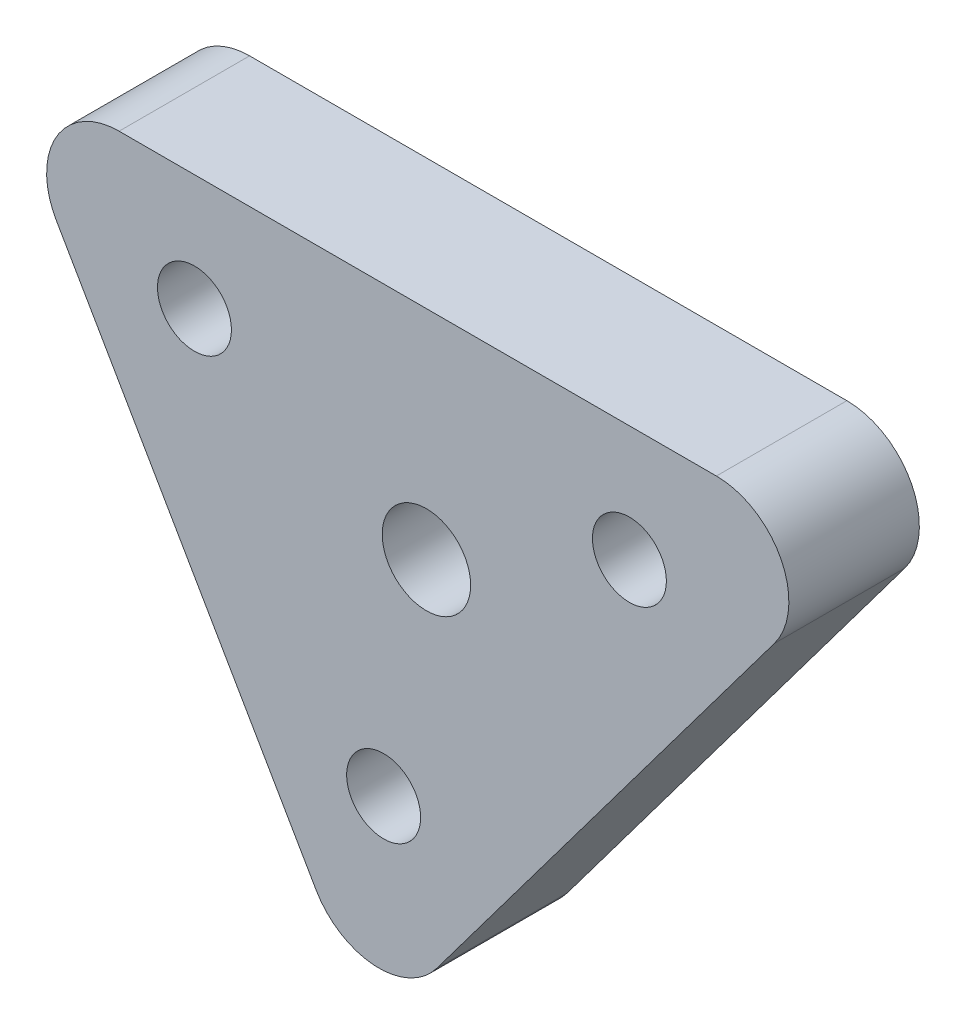
ISO-10303-21;
HEADER;
FILE_DESCRIPTION(('STEP AP214'),'2;1');
FILE_NAME('part.step','',(''),(''),'','','');
FILE_SCHEMA(('AUTOMOTIVE_DESIGN { 1 0 10303 214 1 1 1 1 }'));
ENDSEC;
DATA;
#1=APPLICATION_CONTEXT('core data for automotive mechanical design processes');
#2=APPLICATION_PROTOCOL_DEFINITION('international standard','automotive_design',2000,#1);
#3=PRODUCT_CONTEXT('',#1,'mechanical');
#4=PRODUCT('Part','Part','',(#3));
#5=PRODUCT_RELATED_PRODUCT_CATEGORY('part','',(#4));
#6=PRODUCT_DEFINITION_FORMATION('','',#4);
#7=PRODUCT_DEFINITION_CONTEXT('part definition',#1,'design');
#8=PRODUCT_DEFINITION('design','',#6,#7);
#9=PRODUCT_DEFINITION_SHAPE('','',#8);
#10=(LENGTH_UNIT() NAMED_UNIT(*) SI_UNIT(.MILLI.,.METRE.));
#11=(NAMED_UNIT(*) PLANE_ANGLE_UNIT() SI_UNIT($,.RADIAN.));
#12=(NAMED_UNIT(*) SI_UNIT($,.STERADIAN.) SOLID_ANGLE_UNIT());
#13=UNCERTAINTY_MEASURE_WITH_UNIT(LENGTH_MEASURE(1.E-05),#10,'distance_accuracy_value','');
#14=(GEOMETRIC_REPRESENTATION_CONTEXT(3) GLOBAL_UNCERTAINTY_ASSIGNED_CONTEXT((#13)) GLOBAL_UNIT_ASSIGNED_CONTEXT((#10,
#11,#12)) REPRESENTATION_CONTEXT('',''));
#15=CARTESIAN_POINT('',(0.,0.,0.));
#16=DIRECTION('',(0.,0.,1.));
#17=DIRECTION('',(1.,0.,0.));
#18=AXIS2_PLACEMENT_3D('',#15,#16,#17);
#19=CARTESIAN_POINT('',(0.,0.,9.));
#20=DIRECTION('',(0.,0.,1.));
#21=DIRECTION('',(1.,0.,0.));
#22=AXIS2_PLACEMENT_3D('',#19,#20,#21);
#23=PLANE('',#22);
#24=CARTESIAN_POINT('',(-10.1970443349741,19.3205148577792,9.));
#25=DIRECTION('',(0.,0.,1.));
#26=DIRECTION('',(1.,0.,0.));
#27=AXIS2_PLACEMENT_3D('',#24,#25,#26);
#28=CIRCLE('',#27,2.55);
#29=CARTESIAN_POINT('',(-7.64704433497411,19.3205148577792,9.));
#30=VERTEX_POINT('',#29);
#31=EDGE_CURVE('E269',#30,#30,#28,.T.);
#32=ORIENTED_EDGE('',*,*,#31,.F.);
#33=EDGE_LOOP('',(#32));
#34=FACE_BOUND('',#33,.T.);
#35=CARTESIAN_POINT('',(-27.148108814538,-3.28090444830602,9.));
#36=DIRECTION('',(0.,0.,1.));
#37=DIRECTION('',(1.,0.,0.));
#38=AXIS2_PLACEMENT_3D('',#35,#36,#37);
#39=CIRCLE('',#38,2.55);
#40=CARTESIAN_POINT('',(-24.598108814538,-3.28090444830602,9.));
#41=VERTEX_POINT('',#40);
#42=EDGE_CURVE('E120',#41,#41,#39,.T.);
#43=ORIENTED_EDGE('',*,*,#42,.F.);
#44=EDGE_LOOP('',(#43));
#45=FACE_BOUND('',#44,.T.);
#46=DIRECTION('',(0.500000000000004,-0.866025403784436,0.));
#47=VECTOR('',#46,1.);
#48=CARTESIAN_POINT('',(-28.0180378492337,-17.7741431612336,9.));
#49=LINE('',#48,#47);
#50=CARTESIAN_POINT('',(-49.7233237766029,19.8205148577792,9.));
#51=VERTEX_POINT('',#50);
#52=CARTESIAN_POINT('',(-31.8044592214711,-11.2158689656539,9.));
#53=VERTEX_POINT('',#52);
#54=EDGE_CURVE('E118',#51,#53,#49,.T.);
#55=ORIENTED_EDGE('',*,*,#54,.T.);
#56=CARTESIAN_POINT('',(-27.4743322025489,-8.71586896565388,9.));
#57=DIRECTION('',(0.,0.,1.));
#58=DIRECTION('',(1.,0.,0.));
#59=AXIS2_PLACEMENT_3D('',#56,#57,#58);
#60=CIRCLE('',#59,5.);
#61=CARTESIAN_POINT('',(-23.4743322025489,-11.7158689656539,9.));
#62=VERTEX_POINT('',#61);
#63=EDGE_CURVE('E134',#53,#62,#60,.T.);
#64=ORIENTED_EDGE('',*,*,#63,.T.);
#65=DIRECTION('',(0.6,0.8,0.));
#66=VECTOR('',#65,1.);
#67=CARTESIAN_POINT('',(5.80295566502587,27.3205148577792,9.));
#68=LINE('',#67,#66);
#69=CARTESIAN_POINT('',(-0.197044334974119,19.3205148577792,9.));
#70=VERTEX_POINT('',#69);
#71=EDGE_CURVE('E108',#62,#70,#68,.T.);
#72=ORIENTED_EDGE('',*,*,#71,.T.);
#73=CARTESIAN_POINT('',(-4.19704433497412,22.3205148577792,9.));
#74=DIRECTION('',(0.,0.,1.));
#75=DIRECTION('',(1.,0.,0.));
#76=AXIS2_PLACEMENT_3D('',#73,#74,#75);
#77=CIRCLE('',#76,5.);
#78=CARTESIAN_POINT('',(-4.19704433497412,27.3205148577792,9.));
#79=VERTEX_POINT('',#78);
#80=EDGE_CURVE('E56',#70,#79,#77,.T.);
#81=ORIENTED_EDGE('',*,*,#80,.T.);
#82=DIRECTION('',(-1.,0.,0.));
#83=VECTOR('',#82,1.);
#84=CARTESIAN_POINT('',(-54.0534507955252,27.3205148577792,9.));
#85=LINE('',#84,#83);
#86=CARTESIAN_POINT('',(-45.3931967576808,27.3205148577792,9.));
#87=VERTEX_POINT('',#86);
#88=EDGE_CURVE('E124',#79,#87,#85,.T.);
#89=ORIENTED_EDGE('',*,*,#88,.T.);
#90=CARTESIAN_POINT('',(-45.3931967576808,22.3205148577792,9.));
#91=DIRECTION('',(0.,0.,1.));
#92=DIRECTION('',(1.,0.,0.));
#93=AXIS2_PLACEMENT_3D('',#90,#91,#92);
#94=CIRCLE('',#93,5.);
#95=EDGE_CURVE('E131',#87,#51,#94,.T.);
#96=ORIENTED_EDGE('',*,*,#95,.T.);
#97=EDGE_LOOP('',(#55,#64,#72,#81,#89,#96));
#98=FACE_BOUND('',#97,.T.);
#99=CARTESIAN_POINT('',(-40.1970443349741,19.3205148577792,9.));
#100=DIRECTION('',(0.,0.,1.));
#101=DIRECTION('',(1.,0.,0.));
#102=AXIS2_PLACEMENT_3D('',#99,#100,#101);
#103=CIRCLE('',#102,2.55);
#104=CARTESIAN_POINT('',(-37.6470443349741,19.3205148577792,9.));
#105=VERTEX_POINT('',#104);
#106=EDGE_CURVE('E275',#105,#105,#103,.T.);
#107=ORIENTED_EDGE('',*,*,#106,.F.);
#108=EDGE_LOOP('',(#107));
#109=FACE_BOUND('',#108,.T.);
#110=CARTESIAN_POINT('',(-24.1970443349741,12.3205148577792,9.));
#111=DIRECTION('',(0.,0.,1.));
#112=DIRECTION('',(1.,0.,0.));
#113=AXIS2_PLACEMENT_3D('',#110,#111,#112);
#114=CIRCLE('',#113,3.05);
#115=CARTESIAN_POINT('',(-21.1470443349741,12.3205148577792,9.));
#116=VERTEX_POINT('',#115);
#117=EDGE_CURVE('E260',#116,#116,#114,.T.);
#118=ORIENTED_EDGE('',*,*,#117,.F.);
#119=EDGE_LOOP('',(#118));
#120=FACE_BOUND('',#119,.T.);
#121=ADVANCED_FACE('F35',(#34,#45,#98,#109,#120),#23,.T.);
#122=CARTESIAN_POINT('',(0.,0.,0.));
#123=DIRECTION('',(0.,0.,1.));
#124=DIRECTION('',(1.,0.,0.));
#125=AXIS2_PLACEMENT_3D('',#122,#123,#124);
#126=PLANE('',#125);
#127=DIRECTION('',(0.6,0.8,0.));
#128=VECTOR('',#127,1.);
#129=CARTESIAN_POINT('',(5.80295566502587,27.3205148577792,0.));
#130=LINE('',#129,#128);
#131=CARTESIAN_POINT('',(-23.4743322025489,-11.7158689656539,0.));
#132=VERTEX_POINT('',#131);
#133=CARTESIAN_POINT('',(-0.197044334974119,19.3205148577792,0.));
#134=VERTEX_POINT('',#133);
#135=EDGE_CURVE('E106',#132,#134,#130,.T.);
#136=ORIENTED_EDGE('',*,*,#135,.F.);
#137=CARTESIAN_POINT('',(-27.4743322025489,-8.71586896565388,0.));
#138=DIRECTION('',(0.,0.,1.));
#139=DIRECTION('',(1.,0.,0.));
#140=AXIS2_PLACEMENT_3D('',#137,#138,#139);
#141=CIRCLE('',#140,5.);
#142=CARTESIAN_POINT('',(-31.8044592214711,-11.2158689656539,0.));
#143=VERTEX_POINT('',#142);
#144=EDGE_CURVE('E89',#132,#143,#141,.F.);
#145=ORIENTED_EDGE('',*,*,#144,.T.);
#146=DIRECTION('',(0.500000000000004,-0.866025403784436,0.));
#147=VECTOR('',#146,1.);
#148=CARTESIAN_POINT('',(-28.0180378492337,-17.7741431612336,0.));
#149=LINE('',#148,#147);
#150=CARTESIAN_POINT('',(-49.7233237766029,19.8205148577792,0.));
#151=VERTEX_POINT('',#150);
#152=EDGE_CURVE('E116',#151,#143,#149,.T.);
#153=ORIENTED_EDGE('',*,*,#152,.F.);
#154=CARTESIAN_POINT('',(-45.3931967576808,22.3205148577792,0.));
#155=DIRECTION('',(0.,0.,1.));
#156=DIRECTION('',(1.,0.,0.));
#157=AXIS2_PLACEMENT_3D('',#154,#155,#156);
#158=CIRCLE('',#157,5.);
#159=CARTESIAN_POINT('',(-45.3931967576808,27.3205148577792,0.));
#160=VERTEX_POINT('',#159);
#161=EDGE_CURVE('E109',#151,#160,#158,.F.);
#162=ORIENTED_EDGE('',*,*,#161,.T.);
#163=DIRECTION('',(-1.,0.,0.));
#164=VECTOR('',#163,1.);
#165=CARTESIAN_POINT('',(-54.0534507955252,27.3205148577792,0.));
#166=LINE('',#165,#164);
#167=CARTESIAN_POINT('',(-4.19704433497412,27.3205148577792,0.));
#168=VERTEX_POINT('',#167);
#169=EDGE_CURVE('E115',#168,#160,#166,.T.);
#170=ORIENTED_EDGE('',*,*,#169,.F.);
#171=CARTESIAN_POINT('',(-4.19704433497412,22.3205148577792,0.));
#172=DIRECTION('',(0.,0.,1.));
#173=DIRECTION('',(1.,0.,0.));
#174=AXIS2_PLACEMENT_3D('',#171,#172,#173);
#175=CIRCLE('',#174,5.);
#176=EDGE_CURVE('E100',#168,#134,#175,.F.);
#177=ORIENTED_EDGE('',*,*,#176,.T.);
#178=EDGE_LOOP('',(#136,#145,#153,#162,#170,#177));
#179=FACE_BOUND('',#178,.T.);
#180=CARTESIAN_POINT('',(-27.148108814538,-3.28090444830602,0.));
#181=DIRECTION('',(0.,0.,1.));
#182=DIRECTION('',(1.,0.,0.));
#183=AXIS2_PLACEMENT_3D('',#180,#181,#182);
#184=CIRCLE('',#183,2.55);
#185=CARTESIAN_POINT('',(-24.598108814538,-3.28090444830602,0.));
#186=VERTEX_POINT('',#185);
#187=EDGE_CURVE('E144',#186,#186,#184,.T.);
#188=ORIENTED_EDGE('',*,*,#187,.T.);
#189=EDGE_LOOP('',(#188));
#190=FACE_BOUND('',#189,.T.);
#191=CARTESIAN_POINT('',(-40.1970443349741,19.3205148577792,0.));
#192=DIRECTION('',(0.,0.,1.));
#193=DIRECTION('',(1.,0.,0.));
#194=AXIS2_PLACEMENT_3D('',#191,#192,#193);
#195=CIRCLE('',#194,2.55);
#196=CARTESIAN_POINT('',(-37.6470443349741,19.3205148577792,0.));
#197=VERTEX_POINT('',#196);
#198=EDGE_CURVE('E272',#197,#197,#195,.T.);
#199=ORIENTED_EDGE('',*,*,#198,.T.);
#200=EDGE_LOOP('',(#199));
#201=FACE_BOUND('',#200,.T.);
#202=CARTESIAN_POINT('',(-10.1970443349741,19.3205148577792,0.));
#203=DIRECTION('',(0.,0.,1.));
#204=DIRECTION('',(1.,0.,0.));
#205=AXIS2_PLACEMENT_3D('',#202,#203,#204);
#206=CIRCLE('',#205,2.55);
#207=CARTESIAN_POINT('',(-7.64704433497411,19.3205148577792,0.));
#208=VERTEX_POINT('',#207);
#209=EDGE_CURVE('E266',#208,#208,#206,.T.);
#210=ORIENTED_EDGE('',*,*,#209,.T.);
#211=EDGE_LOOP('',(#210));
#212=FACE_BOUND('',#211,.T.);
#213=CARTESIAN_POINT('',(-24.1970443349741,12.3205148577792,0.));
#214=DIRECTION('',(0.,0.,1.));
#215=DIRECTION('',(1.,0.,0.));
#216=AXIS2_PLACEMENT_3D('',#213,#214,#215);
#217=CIRCLE('',#216,3.05);
#218=CARTESIAN_POINT('',(-21.1470443349741,12.3205148577792,0.));
#219=VERTEX_POINT('',#218);
#220=EDGE_CURVE('E263',#219,#219,#217,.T.);
#221=ORIENTED_EDGE('',*,*,#220,.T.);
#222=EDGE_LOOP('',(#221));
#223=FACE_BOUND('',#222,.T.);
#224=ADVANCED_FACE('F112',(#179,#190,#201,#212,#223),#126,.F.);
#225=CARTESIAN_POINT('',(-28.0180378492337,-17.7741431612336,9.));
#226=DIRECTION('',(0.866025403784436,0.500000000000004,0.));
#227=DIRECTION('',(-0.500000000000004,0.866025403784436,0.));
#228=AXIS2_PLACEMENT_3D('',#225,#226,#227);
#229=PLANE('',#228);
#230=ORIENTED_EDGE('',*,*,#152,.T.);
#231=DIRECTION('',(0.,0.,-1.));
#232=VECTOR('',#231,1.);
#233=CARTESIAN_POINT('',(-31.8044592214711,-11.2158689656539,9.));
#234=LINE('',#233,#232);
#235=EDGE_CURVE('E94',#143,#53,#234,.F.);
#236=ORIENTED_EDGE('',*,*,#235,.T.);
#237=ORIENTED_EDGE('',*,*,#54,.F.);
#238=DIRECTION('',(0.,0.,-1.));
#239=VECTOR('',#238,1.);
#240=CARTESIAN_POINT('',(-49.723323776603,19.8205148577792,9.));
#241=LINE('',#240,#239);
#242=EDGE_CURVE('E99',#51,#151,#241,.T.);
#243=ORIENTED_EDGE('',*,*,#242,.T.);
#244=EDGE_LOOP('',(#230,#236,#237,#243));
#245=FACE_BOUND('',#244,.T.);
#246=ADVANCED_FACE('F148',(#245),#229,.F.);
#247=CARTESIAN_POINT('',(5.80295566502587,27.3205148577792,9.));
#248=DIRECTION('',(-0.8,0.599999999999999,0.));
#249=DIRECTION('',(-0.6,-0.800000000000001,0.));
#250=AXIS2_PLACEMENT_3D('',#247,#248,#249);
#251=PLANE('',#250);
#252=ORIENTED_EDGE('',*,*,#71,.F.);
#253=DIRECTION('',(0.,0.,-1.));
#254=VECTOR('',#253,1.);
#255=CARTESIAN_POINT('',(-23.4743322025489,-11.7158689656539,9.));
#256=LINE('',#255,#254);
#257=EDGE_CURVE('E93',#62,#132,#256,.T.);
#258=ORIENTED_EDGE('',*,*,#257,.T.);
#259=ORIENTED_EDGE('',*,*,#135,.T.);
#260=DIRECTION('',(0.,0.,-1.));
#261=VECTOR('',#260,1.);
#262=CARTESIAN_POINT('',(-0.197044334974118,19.3205148577792,9.));
#263=LINE('',#262,#261);
#264=EDGE_CURVE('E110',#134,#70,#263,.F.);
#265=ORIENTED_EDGE('',*,*,#264,.T.);
#266=EDGE_LOOP('',(#252,#258,#259,#265));
#267=FACE_BOUND('',#266,.T.);
#268=ADVANCED_FACE('F105',(#267),#251,.F.);
#269=CARTESIAN_POINT('',(-54.0534507955252,27.3205148577792,9.));
#270=DIRECTION('',(0.,-1.,0.));
#271=DIRECTION('',(0.,0.,-1.));
#272=AXIS2_PLACEMENT_3D('',#269,#270,#271);
#273=PLANE('',#272);
#274=ORIENTED_EDGE('',*,*,#88,.F.);
#275=DIRECTION('',(0.,0.,-1.));
#276=VECTOR('',#275,1.);
#277=CARTESIAN_POINT('',(-4.19704433497412,27.3205148577792,9.));
#278=LINE('',#277,#276);
#279=EDGE_CURVE('E11',#79,#168,#278,.T.);
#280=ORIENTED_EDGE('',*,*,#279,.T.);
#281=ORIENTED_EDGE('',*,*,#169,.T.);
#282=DIRECTION('',(0.,0.,-1.));
#283=VECTOR('',#282,1.);
#284=CARTESIAN_POINT('',(-45.3931967576808,27.3205148577792,9.));
#285=LINE('',#284,#283);
#286=EDGE_CURVE('E43',#160,#87,#285,.F.);
#287=ORIENTED_EDGE('',*,*,#286,.T.);
#288=EDGE_LOOP('',(#274,#280,#281,#287));
#289=FACE_BOUND('',#288,.T.);
#290=ADVANCED_FACE('F149',(#289),#273,.F.);
#291=CARTESIAN_POINT('',(-27.148108814538,-3.28090444830602,9.));
#292=DIRECTION('',(0.,0.,-1.));
#293=DIRECTION('',(-1.,0.,0.));
#294=AXIS2_PLACEMENT_3D('',#291,#292,#293);
#295=CYLINDRICAL_SURFACE('',#294,2.55);
#296=ORIENTED_EDGE('',*,*,#42,.T.);
#297=EDGE_LOOP('',(#296));
#298=FACE_BOUND('',#297,.T.);
#299=ORIENTED_EDGE('',*,*,#187,.F.);
#300=EDGE_LOOP('',(#299));
#301=FACE_BOUND('',#300,.T.);
#302=ADVANCED_FACE('F169',(#298,#301),#295,.F.);
#303=CARTESIAN_POINT('',(-40.1970443349741,19.3205148577792,9.));
#304=DIRECTION('',(0.,0.,-1.));
#305=DIRECTION('',(-1.,0.,0.));
#306=AXIS2_PLACEMENT_3D('',#303,#304,#305);
#307=CYLINDRICAL_SURFACE('',#306,2.55);
#308=ORIENTED_EDGE('',*,*,#106,.T.);
#309=EDGE_LOOP('',(#308));
#310=FACE_BOUND('',#309,.T.);
#311=ORIENTED_EDGE('',*,*,#198,.F.);
#312=EDGE_LOOP('',(#311));
#313=FACE_BOUND('',#312,.T.);
#314=ADVANCED_FACE('F196',(#310,#313),#307,.F.);
#315=CARTESIAN_POINT('',(-10.1970443349741,19.3205148577792,9.));
#316=DIRECTION('',(0.,0.,-1.));
#317=DIRECTION('',(-1.,0.,0.));
#318=AXIS2_PLACEMENT_3D('',#315,#316,#317);
#319=CYLINDRICAL_SURFACE('',#318,2.55);
#320=ORIENTED_EDGE('',*,*,#31,.T.);
#321=EDGE_LOOP('',(#320));
#322=FACE_BOUND('',#321,.T.);
#323=ORIENTED_EDGE('',*,*,#209,.F.);
#324=EDGE_LOOP('',(#323));
#325=FACE_BOUND('',#324,.T.);
#326=ADVANCED_FACE('F203',(#322,#325),#319,.F.);
#327=CARTESIAN_POINT('',(-24.1970443349741,12.3205148577792,9.));
#328=DIRECTION('',(0.,0.,-1.));
#329=DIRECTION('',(-1.,0.,0.));
#330=AXIS2_PLACEMENT_3D('',#327,#328,#329);
#331=CYLINDRICAL_SURFACE('',#330,3.05);
#332=ORIENTED_EDGE('',*,*,#117,.T.);
#333=EDGE_LOOP('',(#332));
#334=FACE_BOUND('',#333,.T.);
#335=ORIENTED_EDGE('',*,*,#220,.F.);
#336=EDGE_LOOP('',(#335));
#337=FACE_BOUND('',#336,.T.);
#338=ADVANCED_FACE('F157',(#334,#337),#331,.F.);
#339=CARTESIAN_POINT('',(-27.4743322025489,-8.71586896565388,9.));
#340=DIRECTION('',(0.,0.,-1.));
#341=DIRECTION('',(-1.,0.,0.));
#342=AXIS2_PLACEMENT_3D('',#339,#340,#341);
#343=CYLINDRICAL_SURFACE('',#342,5.);
#344=ORIENTED_EDGE('',*,*,#63,.F.);
#345=ORIENTED_EDGE('',*,*,#235,.F.);
#346=ORIENTED_EDGE('',*,*,#144,.F.);
#347=ORIENTED_EDGE('',*,*,#257,.F.);
#348=EDGE_LOOP('',(#344,#345,#346,#347));
#349=FACE_BOUND('',#348,.T.);
#350=ADVANCED_FACE('F92',(#349),#343,.T.);
#351=CARTESIAN_POINT('',(-4.19704433497412,22.3205148577792,9.));
#352=DIRECTION('',(0.,0.,-1.));
#353=DIRECTION('',(-1.,0.,0.));
#354=AXIS2_PLACEMENT_3D('',#351,#352,#353);
#355=CYLINDRICAL_SURFACE('',#354,5.);
#356=ORIENTED_EDGE('',*,*,#80,.F.);
#357=ORIENTED_EDGE('',*,*,#264,.F.);
#358=ORIENTED_EDGE('',*,*,#176,.F.);
#359=ORIENTED_EDGE('',*,*,#279,.F.);
#360=EDGE_LOOP('',(#356,#357,#358,#359));
#361=FACE_BOUND('',#360,.T.);
#362=ADVANCED_FACE('F151',(#361),#355,.T.);
#363=CARTESIAN_POINT('',(-45.3931967576808,22.3205148577792,9.));
#364=DIRECTION('',(0.,0.,-1.));
#365=DIRECTION('',(-1.,0.,0.));
#366=AXIS2_PLACEMENT_3D('',#363,#364,#365);
#367=CYLINDRICAL_SURFACE('',#366,5.);
#368=ORIENTED_EDGE('',*,*,#95,.F.);
#369=ORIENTED_EDGE('',*,*,#286,.F.);
#370=ORIENTED_EDGE('',*,*,#161,.F.);
#371=ORIENTED_EDGE('',*,*,#242,.F.);
#372=EDGE_LOOP('',(#368,#369,#370,#371));
#373=FACE_BOUND('',#372,.T.);
#374=ADVANCED_FACE('F37',(#373),#367,.T.);
#375=CLOSED_SHELL('',(#121,#224,#246,#268,#290,#302,#314,#326,#338,#350,#362,#374));
#376=MANIFOLD_SOLID_BREP('B2',#375);
#377=ADVANCED_BREP_SHAPE_REPRESENTATION('',(#18,#376),#14);
#378=SHAPE_DEFINITION_REPRESENTATION(#9,#377);
ENDSEC;
END-ISO-10303-21;
